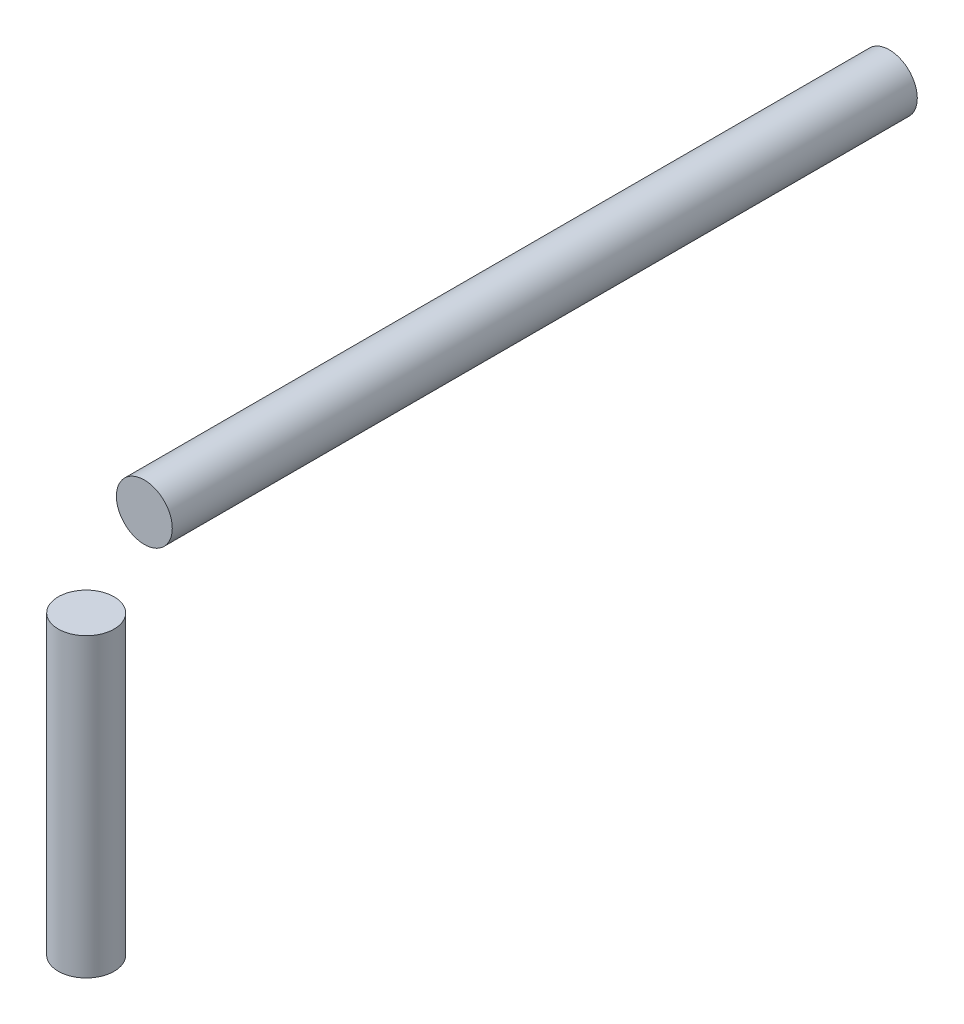
ISO-10303-21;
HEADER;
FILE_DESCRIPTION(('STEP AP214'),'2;1');
FILE_NAME('part.step','',(''),(''),'','','');
FILE_SCHEMA(('AUTOMOTIVE_DESIGN { 1 0 10303 214 1 1 1 1 }'));
ENDSEC;
DATA;
#1=APPLICATION_CONTEXT('core data for automotive mechanical design processes');
#2=APPLICATION_PROTOCOL_DEFINITION('international standard','automotive_design',2000,#1);
#3=PRODUCT_CONTEXT('',#1,'mechanical');
#4=PRODUCT('Part','Part','',(#3));
#5=PRODUCT_RELATED_PRODUCT_CATEGORY('part','',(#4));
#6=PRODUCT_DEFINITION_FORMATION('','',#4);
#7=PRODUCT_DEFINITION_CONTEXT('part definition',#1,'design');
#8=PRODUCT_DEFINITION('design','',#6,#7);
#9=PRODUCT_DEFINITION_SHAPE('','',#8);
#10=(LENGTH_UNIT() NAMED_UNIT(*) SI_UNIT(.MILLI.,.METRE.));
#11=(NAMED_UNIT(*) PLANE_ANGLE_UNIT() SI_UNIT($,.RADIAN.));
#12=(NAMED_UNIT(*) SI_UNIT($,.STERADIAN.) SOLID_ANGLE_UNIT());
#13=UNCERTAINTY_MEASURE_WITH_UNIT(LENGTH_MEASURE(1.E-05),#10,'distance_accuracy_value','');
#14=(GEOMETRIC_REPRESENTATION_CONTEXT(3) GLOBAL_UNCERTAINTY_ASSIGNED_CONTEXT((#13)) GLOBAL_UNIT_ASSIGNED_CONTEXT((#10,
#11,#12)) REPRESENTATION_CONTEXT('',''));
#15=CARTESIAN_POINT('',(0.,0.,0.));
#16=DIRECTION('',(0.,0.,1.));
#17=DIRECTION('',(1.,0.,0.));
#18=AXIS2_PLACEMENT_3D('',#15,#16,#17);
#19=CARTESIAN_POINT('',(-36.068,-13.208,159.618680000001));
#20=DIRECTION('',(0.,-1.,0.));
#21=DIRECTION('',(1.,0.,0.));
#22=AXIS2_PLACEMENT_3D('',#19,#20,#21);
#23=PLANE('',#22);
#24=CARTESIAN_POINT('',(-36.068,-13.208,159.618680000001));
#25=DIRECTION('',(0.,-1.,0.));
#26=DIRECTION('',(1.,0.,0.));
#27=AXIS2_PLACEMENT_3D('',#24,#25,#26);
#28=CIRCLE('',#27,6.34999999999999);
#29=CARTESIAN_POINT('',(-29.718,-13.208,159.618680000001));
#30=VERTEX_POINT('',#29);
#31=EDGE_CURVE('E49',#30,#30,#28,.T.);
#32=ORIENTED_EDGE('',*,*,#31,.F.);
#33=EDGE_LOOP('',(#32));
#34=FACE_BOUND('',#33,.T.);
#35=ADVANCED_FACE('F42',(#34),#23,.F.);
#36=CARTESIAN_POINT('',(-36.068,-98.5197563526684,159.618680000001));
#37=DIRECTION('',(0.,1.,0.));
#38=DIRECTION('',(-1.,0.,0.));
#39=AXIS2_PLACEMENT_3D('',#36,#37,#38);
#40=CYLINDRICAL_SURFACE('',#39,6.34999999999999);
#41=CARTESIAN_POINT('',(-36.068,-80.5592441105301,159.618680000001));
#42=DIRECTION('',(0.,1.,0.));
#43=DIRECTION('',(0.,0.,1.));
#44=AXIS2_PLACEMENT_3D('',#41,#42,#43);
#45=CIRCLE('',#44,6.34999999999999);
#46=CARTESIAN_POINT('',(-36.068,-80.5592441105301,165.968680000001));
#47=VERTEX_POINT('',#46);
#48=EDGE_CURVE('E11',#47,#47,#45,.T.);
#49=ORIENTED_EDGE('',*,*,#48,.T.);
#50=EDGE_LOOP('',(#49));
#51=FACE_BOUND('',#50,.T.);
#52=ORIENTED_EDGE('',*,*,#31,.T.);
#53=EDGE_LOOP('',(#52));
#54=FACE_BOUND('',#53,.T.);
#55=ADVANCED_FACE('F44',(#51,#54),#40,.T.);
#56=CARTESIAN_POINT('',(0.,-80.5592441105301,0.));
#57=DIRECTION('',(0.,1.,0.));
#58=DIRECTION('',(0.,0.,1.));
#59=AXIS2_PLACEMENT_3D('',#56,#57,#58);
#60=PLANE('',#59);
#61=ORIENTED_EDGE('',*,*,#48,.F.);
#62=EDGE_LOOP('',(#61));
#63=FACE_BOUND('',#62,.T.);
#64=ADVANCED_FACE('F60',(#63),#60,.F.);
#65=CLOSED_SHELL('',(#35,#55,#64));
#66=MANIFOLD_SOLID_BREP('B2',#65);
#67=CARTESIAN_POINT('',(0.,0.,-22.86));
#68=DIRECTION('',(0.,0.,-1.));
#69=DIRECTION('',(-1.,0.,0.));
#70=AXIS2_PLACEMENT_3D('',#67,#68,#69);
#71=PLANE('',#70);
#72=CARTESIAN_POINT('',(-36.068,0.,-22.86));
#73=DIRECTION('',(0.,0.,-1.));
#74=DIRECTION('',(-1.,0.,0.));
#75=AXIS2_PLACEMENT_3D('',#72,#73,#74);
#76=CIRCLE('',#75,6.35);
#77=CARTESIAN_POINT('',(-42.418,0.,-22.86));
#78=VERTEX_POINT('',#77);
#79=EDGE_CURVE('E41',#78,#78,#76,.F.);
#80=ORIENTED_EDGE('',*,*,#79,.F.);
#81=EDGE_LOOP('',(#80));
#82=FACE_BOUND('',#81,.T.);
#83=ADVANCED_FACE('F91',(#82),#71,.T.);
#84=CARTESIAN_POINT('',(-36.068,0.,146.410680000001));
#85=DIRECTION('',(0.,0.,1.));
#86=DIRECTION('',(1.,0.,0.));
#87=AXIS2_PLACEMENT_3D('',#84,#85,#86);
#88=PLANE('',#87);
#89=CARTESIAN_POINT('',(-36.068,0.,146.410680000001));
#90=DIRECTION('',(0.,0.,1.));
#91=DIRECTION('',(1.,0.,0.));
#92=AXIS2_PLACEMENT_3D('',#89,#90,#91);
#93=CIRCLE('',#92,6.35);
#94=CARTESIAN_POINT('',(-29.718,0.,146.410680000001));
#95=VERTEX_POINT('',#94);
#96=EDGE_CURVE('E97',#95,#95,#93,.T.);
#97=ORIENTED_EDGE('',*,*,#96,.T.);
#98=EDGE_LOOP('',(#97));
#99=FACE_BOUND('',#98,.T.);
#100=ADVANCED_FACE('F103',(#99),#88,.T.);
#101=CARTESIAN_POINT('',(-36.068,0.,-40.8205122421383));
#102=DIRECTION('',(0.,0.,1.));
#103=DIRECTION('',(1.,0.,0.));
#104=AXIS2_PLACEMENT_3D('',#101,#102,#103);
#105=CYLINDRICAL_SURFACE('',#104,6.35);
#106=ORIENTED_EDGE('',*,*,#96,.F.);
#107=EDGE_LOOP('',(#106));
#108=FACE_BOUND('',#107,.T.);
#109=ORIENTED_EDGE('',*,*,#79,.T.);
#110=EDGE_LOOP('',(#109));
#111=FACE_BOUND('',#110,.T.);
#112=ADVANCED_FACE('F105',(#108,#111),#105,.T.);
#113=CLOSED_SHELL('',(#83,#100,#112));
#114=MANIFOLD_SOLID_BREP('B6',#113);
#115=ADVANCED_BREP_SHAPE_REPRESENTATION('',(#18,#66,#114),#14);
#116=SHAPE_DEFINITION_REPRESENTATION(#9,#115);
ENDSEC;
END-ISO-10303-21;
